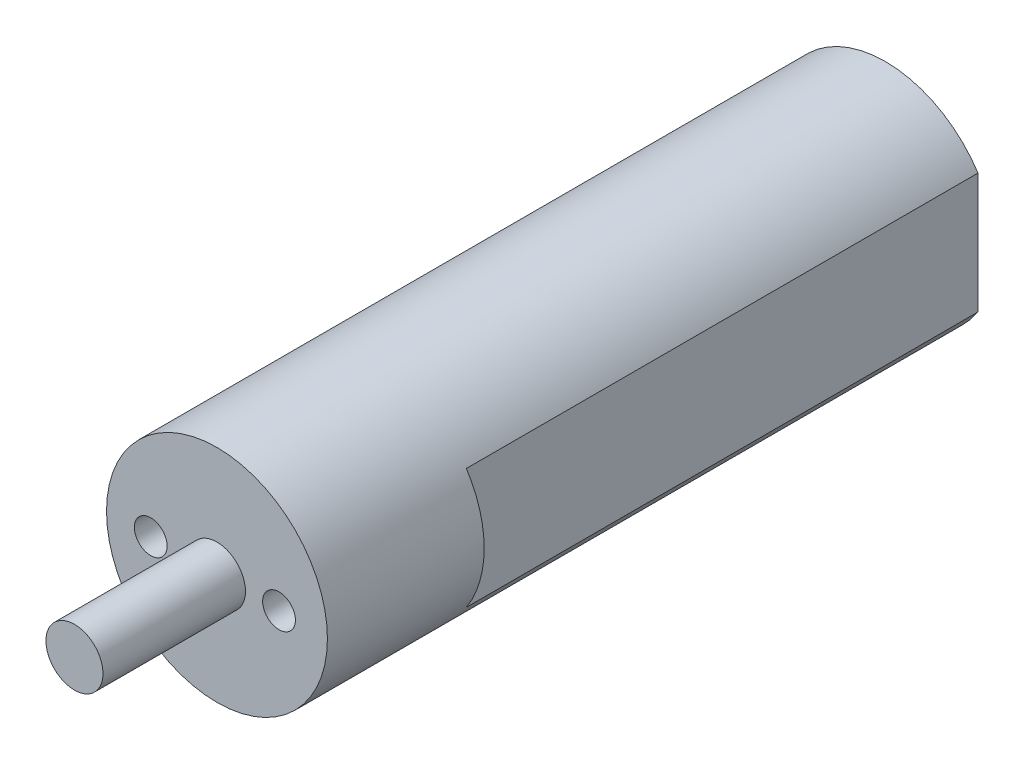
ISO-10303-21;
HEADER;
FILE_DESCRIPTION(('STEP AP214'),'2;1');
FILE_NAME('part.step','',(''),(''),'','','');
FILE_SCHEMA(('AUTOMOTIVE_DESIGN { 1 0 10303 214 1 1 1 1 }'));
ENDSEC;
DATA;
#1=APPLICATION_CONTEXT('core data for automotive mechanical design processes');
#2=APPLICATION_PROTOCOL_DEFINITION('international standard','automotive_design',2000,#1);
#3=PRODUCT_CONTEXT('',#1,'mechanical');
#4=PRODUCT('Part','Part','',(#3));
#5=PRODUCT_RELATED_PRODUCT_CATEGORY('part','',(#4));
#6=PRODUCT_DEFINITION_FORMATION('','',#4);
#7=PRODUCT_DEFINITION_CONTEXT('part definition',#1,'design');
#8=PRODUCT_DEFINITION('design','',#6,#7);
#9=PRODUCT_DEFINITION_SHAPE('','',#8);
#10=(LENGTH_UNIT() NAMED_UNIT(*) SI_UNIT(.MILLI.,.METRE.));
#11=(NAMED_UNIT(*) PLANE_ANGLE_UNIT() SI_UNIT($,.RADIAN.));
#12=(NAMED_UNIT(*) SI_UNIT($,.STERADIAN.) SOLID_ANGLE_UNIT());
#13=UNCERTAINTY_MEASURE_WITH_UNIT(LENGTH_MEASURE(1.E-05),#10,'distance_accuracy_value','');
#14=(GEOMETRIC_REPRESENTATION_CONTEXT(3) GLOBAL_UNCERTAINTY_ASSIGNED_CONTEXT((#13)) GLOBAL_UNIT_ASSIGNED_CONTEXT((#10,
#11,#12)) REPRESENTATION_CONTEXT('',''));
#15=CARTESIAN_POINT('',(0.,0.,0.));
#16=DIRECTION('',(0.,0.,1.));
#17=DIRECTION('',(1.,0.,0.));
#18=AXIS2_PLACEMENT_3D('',#15,#16,#17);
#19=CARTESIAN_POINT('',(0.,0.,-11.));
#20=DIRECTION('',(0.,0.,1.));
#21=DIRECTION('',(1.,0.,0.));
#22=AXIS2_PLACEMENT_3D('',#19,#20,#21);
#23=PLANE('',#22);
#24=DIRECTION('',(0.,1.,0.));
#25=VECTOR('',#24,1.);
#26=CARTESIAN_POINT('',(-6.5,4.22048575403353,-11.));
#27=LINE('',#26,#25);
#28=CARTESIAN_POINT('',(-6.5,-4.22048575403353,-11.));
#29=VERTEX_POINT('',#28);
#30=CARTESIAN_POINT('',(-6.5,4.22048575403353,-11.));
#31=VERTEX_POINT('',#30);
#32=EDGE_CURVE('E51',#29,#31,#27,.T.);
#33=ORIENTED_EDGE('',*,*,#32,.F.);
#34=CARTESIAN_POINT('',(0.,0.,-11.));
#35=DIRECTION('',(0.,0.,1.));
#36=DIRECTION('',(1.,0.,0.));
#37=AXIS2_PLACEMENT_3D('',#34,#35,#36);
#38=CIRCLE('',#37,7.75);
#39=EDGE_CURVE('E11',#31,#29,#38,.T.);
#40=ORIENTED_EDGE('',*,*,#39,.F.);
#41=EDGE_LOOP('',(#33,#40));
#42=FACE_BOUND('',#41,.T.);
#43=ADVANCED_FACE('F35',(#42),#23,.F.);
#44=DIRECTION('',(0.,-1.,0.));
#45=VECTOR('',#44,1.);
#46=CARTESIAN_POINT('',(6.5,4.22048575403353,-11.));
#47=LINE('',#46,#45);
#48=CARTESIAN_POINT('',(6.5,4.22048575403353,-11.));
#49=VERTEX_POINT('',#48);
#50=CARTESIAN_POINT('',(6.5,-4.22048575403353,-11.));
#51=VERTEX_POINT('',#50);
#52=EDGE_CURVE('E110',#49,#51,#47,.T.);
#53=ORIENTED_EDGE('',*,*,#52,.F.);
#54=EDGE_CURVE('E44',#51,#49,#38,.T.);
#55=ORIENTED_EDGE('',*,*,#54,.F.);
#56=EDGE_LOOP('',(#53,#55));
#57=FACE_BOUND('',#56,.T.);
#58=ADVANCED_FACE('F159',(#57),#23,.F.);
#59=CARTESIAN_POINT('',(0.,0.,-11.));
#60=DIRECTION('',(0.,0.,1.));
#61=DIRECTION('',(1.,0.,0.));
#62=AXIS2_PLACEMENT_3D('',#59,#60,#61);
#63=CYLINDRICAL_SURFACE('',#62,7.75);
#64=ORIENTED_EDGE('',*,*,#54,.T.);
#65=DIRECTION('',(0.,0.,1.));
#66=VECTOR('',#65,1.);
#67=CARTESIAN_POINT('',(6.5,4.22048575403353,-46.9));
#68=LINE('',#67,#66);
#69=CARTESIAN_POINT('',(6.5,4.22048575403353,-46.9));
#70=VERTEX_POINT('',#69);
#71=EDGE_CURVE('E78',#70,#49,#68,.T.);
#72=ORIENTED_EDGE('',*,*,#71,.F.);
#73=CARTESIAN_POINT('',(0.,0.,-46.9));
#74=DIRECTION('',(0.,0.,-1.));
#75=DIRECTION('',(-1.,0.,0.));
#76=AXIS2_PLACEMENT_3D('',#73,#74,#75);
#77=CIRCLE('',#76,7.75);
#78=CARTESIAN_POINT('',(-6.5,4.22048575403353,-46.9));
#79=VERTEX_POINT('',#78);
#80=EDGE_CURVE('E84',#79,#70,#77,.T.);
#81=ORIENTED_EDGE('',*,*,#80,.F.);
#82=DIRECTION('',(0.,0.,1.));
#83=VECTOR('',#82,1.);
#84=CARTESIAN_POINT('',(-6.5,4.22048575403353,-46.9));
#85=LINE('',#84,#83);
#86=EDGE_CURVE('E111',#79,#31,#85,.T.);
#87=ORIENTED_EDGE('',*,*,#86,.T.);
#88=ORIENTED_EDGE('',*,*,#39,.T.);
#89=DIRECTION('',(0.,0.,1.));
#90=VECTOR('',#89,1.);
#91=CARTESIAN_POINT('',(-6.5,-4.22048575403353,-46.9));
#92=LINE('',#91,#90);
#93=CARTESIAN_POINT('',(-6.5,-4.22048575403353,-46.9));
#94=VERTEX_POINT('',#93);
#95=EDGE_CURVE('E101',#94,#29,#92,.T.);
#96=ORIENTED_EDGE('',*,*,#95,.F.);
#97=CARTESIAN_POINT('',(0.,0.,-46.9));
#98=DIRECTION('',(0.,0.,-1.));
#99=DIRECTION('',(-1.,0.,0.));
#100=AXIS2_PLACEMENT_3D('',#97,#98,#99);
#101=CIRCLE('',#100,7.75);
#102=CARTESIAN_POINT('',(6.5,-4.22048575403353,-46.9));
#103=VERTEX_POINT('',#102);
#104=EDGE_CURVE('E83',#103,#94,#101,.T.);
#105=ORIENTED_EDGE('',*,*,#104,.F.);
#106=DIRECTION('',(0.,0.,1.));
#107=VECTOR('',#106,1.);
#108=CARTESIAN_POINT('',(6.5,-4.22048575403353,-46.9));
#109=LINE('',#108,#107);
#110=EDGE_CURVE('E80',#103,#51,#109,.T.);
#111=ORIENTED_EDGE('',*,*,#110,.T.);
#112=EDGE_LOOP('',(#64,#72,#81,#87,#88,#96,#105,#111));
#113=FACE_BOUND('',#112,.T.);
#114=CARTESIAN_POINT('',(0.,0.,0.));
#115=DIRECTION('',(0.,0.,1.));
#116=DIRECTION('',(1.,0.,0.));
#117=AXIS2_PLACEMENT_3D('',#114,#115,#116);
#118=CIRCLE('',#117,7.75);
#119=CARTESIAN_POINT('',(7.75,0.,0.));
#120=VERTEX_POINT('',#119);
#121=EDGE_CURVE('E124',#120,#120,#118,.T.);
#122=ORIENTED_EDGE('',*,*,#121,.F.);
#123=EDGE_LOOP('',(#122));
#124=FACE_BOUND('',#123,.T.);
#125=ADVANCED_FACE('F37',(#113,#124),#63,.T.);
#126=CARTESIAN_POINT('',(0.,0.,0.));
#127=DIRECTION('',(0.,0.,1.));
#128=DIRECTION('',(1.,0.,0.));
#129=AXIS2_PLACEMENT_3D('',#126,#127,#128);
#130=PLANE('',#129);
#131=CARTESIAN_POINT('',(0.,0.,0.));
#132=DIRECTION('',(0.,0.,1.));
#133=DIRECTION('',(1.,0.,0.));
#134=AXIS2_PLACEMENT_3D('',#131,#132,#133);
#135=CIRCLE('',#134,2.);
#136=CARTESIAN_POINT('',(2.,0.,0.));
#137=VERTEX_POINT('',#136);
#138=EDGE_CURVE('E135',#137,#137,#135,.T.);
#139=ORIENTED_EDGE('',*,*,#138,.F.);
#140=EDGE_LOOP('',(#139));
#141=FACE_BOUND('',#140,.T.);
#142=CARTESIAN_POINT('',(-4.6461435043917,0.,0.));
#143=DIRECTION('',(0.,0.,1.));
#144=DIRECTION('',(1.,0.,0.));
#145=AXIS2_PLACEMENT_3D('',#142,#143,#144);
#146=CIRCLE('',#145,1.15);
#147=CARTESIAN_POINT('',(-3.4961435043917,0.,0.));
#148=VERTEX_POINT('',#147);
#149=EDGE_CURVE('E96',#148,#148,#146,.T.);
#150=ORIENTED_EDGE('',*,*,#149,.F.);
#151=EDGE_LOOP('',(#150));
#152=FACE_BOUND('',#151,.T.);
#153=CARTESIAN_POINT('',(4.3538564956083,0.,0.));
#154=DIRECTION('',(0.,0.,1.));
#155=DIRECTION('',(1.,0.,0.));
#156=AXIS2_PLACEMENT_3D('',#153,#154,#155);
#157=CIRCLE('',#156,1.15);
#158=CARTESIAN_POINT('',(5.5038564956083,0.,0.));
#159=VERTEX_POINT('',#158);
#160=EDGE_CURVE('E119',#159,#159,#157,.T.);
#161=ORIENTED_EDGE('',*,*,#160,.F.);
#162=EDGE_LOOP('',(#161));
#163=FACE_BOUND('',#162,.T.);
#164=ORIENTED_EDGE('',*,*,#121,.T.);
#165=EDGE_LOOP('',(#164));
#166=FACE_BOUND('',#165,.T.);
#167=ADVANCED_FACE('F169',(#141,#152,#163,#166),#130,.T.);
#168=CARTESIAN_POINT('',(4.3538564956083,0.,-11.));
#169=DIRECTION('',(0.,0.,1.));
#170=DIRECTION('',(1.,0.,0.));
#171=AXIS2_PLACEMENT_3D('',#168,#169,#170);
#172=CYLINDRICAL_SURFACE('',#171,1.15);
#173=CARTESIAN_POINT('',(4.3538564956083,0.,-11.));
#174=DIRECTION('',(0.,0.,1.));
#175=DIRECTION('',(1.,0.,0.));
#176=AXIS2_PLACEMENT_3D('',#173,#174,#175);
#177=CIRCLE('',#176,1.15);
#178=CARTESIAN_POINT('',(5.5038564956083,0.,-11.));
#179=VERTEX_POINT('',#178);
#180=EDGE_CURVE('E121',#179,#179,#177,.T.);
#181=ORIENTED_EDGE('',*,*,#180,.F.);
#182=EDGE_LOOP('',(#181));
#183=FACE_BOUND('',#182,.T.);
#184=ORIENTED_EDGE('',*,*,#160,.T.);
#185=EDGE_LOOP('',(#184));
#186=FACE_BOUND('',#185,.T.);
#187=ADVANCED_FACE('F167',(#183,#186),#172,.F.);
#188=CARTESIAN_POINT('',(-4.6461435043917,0.,-11.));
#189=DIRECTION('',(0.,0.,1.));
#190=DIRECTION('',(1.,0.,0.));
#191=AXIS2_PLACEMENT_3D('',#188,#189,#190);
#192=CYLINDRICAL_SURFACE('',#191,1.15);
#193=CARTESIAN_POINT('',(-4.6461435043917,0.,-11.));
#194=DIRECTION('',(0.,0.,1.));
#195=DIRECTION('',(1.,0.,0.));
#196=AXIS2_PLACEMENT_3D('',#193,#194,#195);
#197=CIRCLE('',#196,1.15);
#198=CARTESIAN_POINT('',(-3.4961435043917,0.,-11.));
#199=VERTEX_POINT('',#198);
#200=EDGE_CURVE('E99',#199,#199,#197,.T.);
#201=ORIENTED_EDGE('',*,*,#200,.F.);
#202=EDGE_LOOP('',(#201));
#203=FACE_BOUND('',#202,.T.);
#204=ORIENTED_EDGE('',*,*,#149,.T.);
#205=EDGE_LOOP('',(#204));
#206=FACE_BOUND('',#205,.T.);
#207=ADVANCED_FACE('F155',(#203,#206),#192,.F.);
#208=CARTESIAN_POINT('',(0.,0.,-46.9));
#209=DIRECTION('',(0.,0.,-1.));
#210=DIRECTION('',(-1.,0.,0.));
#211=AXIS2_PLACEMENT_3D('',#208,#209,#210);
#212=PLANE('',#211);
#213=ORIENTED_EDGE('',*,*,#80,.T.);
#214=DIRECTION('',(0.,-1.,0.));
#215=VECTOR('',#214,1.);
#216=CARTESIAN_POINT('',(6.5,4.22048575403353,-46.9));
#217=LINE('',#216,#215);
#218=EDGE_CURVE('E73',#70,#103,#217,.T.);
#219=ORIENTED_EDGE('',*,*,#218,.T.);
#220=ORIENTED_EDGE('',*,*,#104,.T.);
#221=DIRECTION('',(0.,1.,0.));
#222=VECTOR('',#221,1.);
#223=CARTESIAN_POINT('',(-6.5,4.22048575403353,-46.9));
#224=LINE('',#223,#222);
#225=EDGE_CURVE('E89',#94,#79,#224,.T.);
#226=ORIENTED_EDGE('',*,*,#225,.T.);
#227=EDGE_LOOP('',(#213,#219,#220,#226));
#228=FACE_BOUND('',#227,.T.);
#229=ADVANCED_FACE('F87',(#228),#212,.T.);
#230=CARTESIAN_POINT('',(-6.5,4.22048575403353,-46.9));
#231=DIRECTION('',(1.,0.,0.));
#232=DIRECTION('',(0.,0.,-1.));
#233=AXIS2_PLACEMENT_3D('',#230,#231,#232);
#234=PLANE('',#233);
#235=ORIENTED_EDGE('',*,*,#32,.T.);
#236=ORIENTED_EDGE('',*,*,#86,.F.);
#237=ORIENTED_EDGE('',*,*,#225,.F.);
#238=ORIENTED_EDGE('',*,*,#95,.T.);
#239=EDGE_LOOP('',(#235,#236,#237,#238));
#240=FACE_BOUND('',#239,.T.);
#241=ADVANCED_FACE('F146',(#240),#234,.F.);
#242=CARTESIAN_POINT('',(6.5,4.22048575403353,-46.9));
#243=DIRECTION('',(-1.,0.,0.));
#244=DIRECTION('',(0.,0.,1.));
#245=AXIS2_PLACEMENT_3D('',#242,#243,#244);
#246=PLANE('',#245);
#247=ORIENTED_EDGE('',*,*,#52,.T.);
#248=ORIENTED_EDGE('',*,*,#110,.F.);
#249=ORIENTED_EDGE('',*,*,#218,.F.);
#250=ORIENTED_EDGE('',*,*,#71,.T.);
#251=EDGE_LOOP('',(#247,#248,#249,#250));
#252=FACE_BOUND('',#251,.T.);
#253=ADVANCED_FACE('F76',(#252),#246,.F.);
#254=CARTESIAN_POINT('',(0.,0.,-11.));
#255=DIRECTION('',(0.,0.,-1.));
#256=DIRECTION('',(-1.,0.,0.));
#257=AXIS2_PLACEMENT_3D('',#254,#255,#256);
#258=PLANE('',#257);
#259=ORIENTED_EDGE('',*,*,#180,.T.);
#260=EDGE_LOOP('',(#259));
#261=FACE_BOUND('',#260,.T.);
#262=ADVANCED_FACE('F153',(#261),#258,.F.);
#263=ORIENTED_EDGE('',*,*,#200,.T.);
#264=EDGE_LOOP('',(#263));
#265=FACE_BOUND('',#264,.T.);
#266=ADVANCED_FACE('F194',(#265),#258,.F.);
#267=CARTESIAN_POINT('',(0.,0.,10.));
#268=DIRECTION('',(0.,0.,-1.));
#269=DIRECTION('',(-1.,0.,0.));
#270=AXIS2_PLACEMENT_3D('',#267,#268,#269);
#271=CYLINDRICAL_SURFACE('',#270,2.);
#272=CARTESIAN_POINT('',(0.,0.,10.));
#273=DIRECTION('',(0.,0.,1.));
#274=DIRECTION('',(1.,0.,0.));
#275=AXIS2_PLACEMENT_3D('',#272,#273,#274);
#276=CIRCLE('',#275,2.);
#277=CARTESIAN_POINT('',(2.,0.,10.));
#278=VERTEX_POINT('',#277);
#279=EDGE_CURVE('E133',#278,#278,#276,.T.);
#280=ORIENTED_EDGE('',*,*,#279,.F.);
#281=EDGE_LOOP('',(#280));
#282=FACE_BOUND('',#281,.T.);
#283=ORIENTED_EDGE('',*,*,#138,.T.);
#284=EDGE_LOOP('',(#283));
#285=FACE_BOUND('',#284,.T.);
#286=ADVANCED_FACE('F196',(#282,#285),#271,.T.);
#287=CARTESIAN_POINT('',(0.,0.,10.));
#288=DIRECTION('',(0.,0.,1.));
#289=DIRECTION('',(1.,0.,0.));
#290=AXIS2_PLACEMENT_3D('',#287,#288,#289);
#291=PLANE('',#290);
#292=ORIENTED_EDGE('',*,*,#279,.T.);
#293=EDGE_LOOP('',(#292));
#294=FACE_BOUND('',#293,.T.);
#295=ADVANCED_FACE('F200',(#294),#291,.T.);
#296=CLOSED_SHELL('',(#43,#58,#125,#167,#187,#207,#229,#241,#253,#262,#266,#286,#295));
#297=MANIFOLD_SOLID_BREP('B2',#296);
#298=ADVANCED_BREP_SHAPE_REPRESENTATION('',(#18,#297),#14);
#299=SHAPE_DEFINITION_REPRESENTATION(#9,#298);
ENDSEC;
END-ISO-10303-21;
